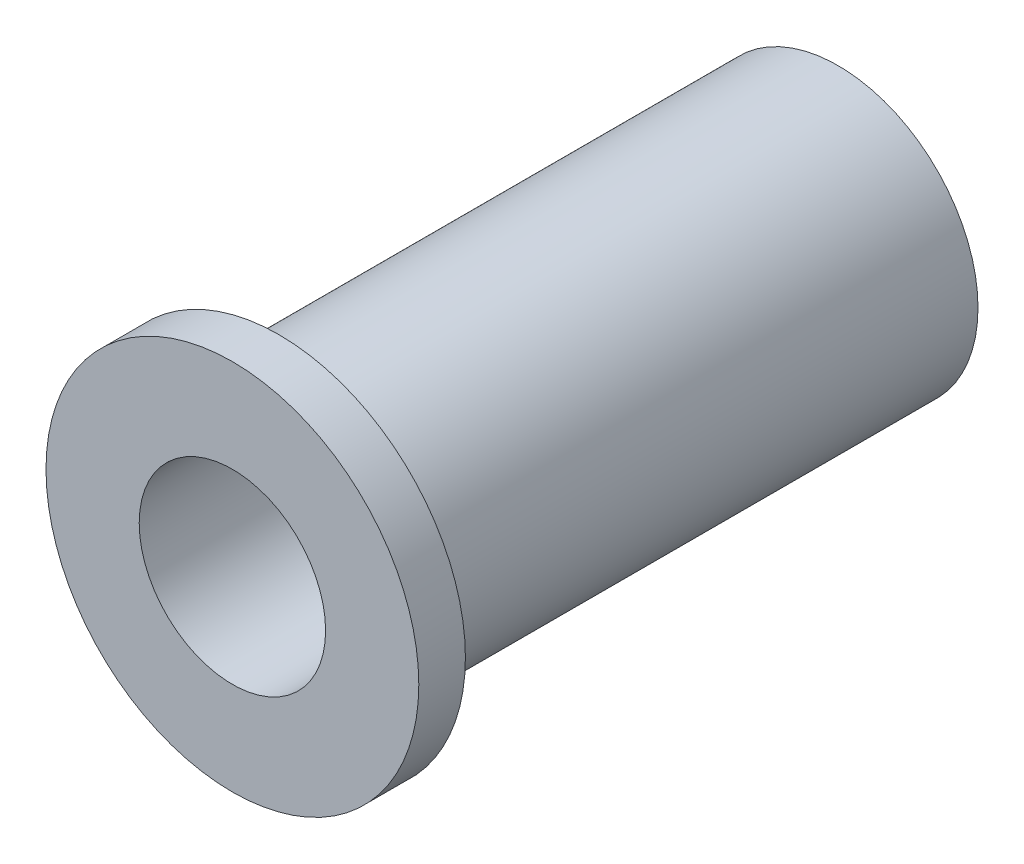
ISO-10303-21;
HEADER;
FILE_DESCRIPTION(('STEP AP214'),'2;1');
FILE_NAME('part.step','',(''),(''),'','','');
FILE_SCHEMA(('AUTOMOTIVE_DESIGN { 1 0 10303 214 1 1 1 1 }'));
ENDSEC;
DATA;
#1=APPLICATION_CONTEXT('core data for automotive mechanical design processes');
#2=APPLICATION_PROTOCOL_DEFINITION('international standard','automotive_design',2000,#1);
#3=PRODUCT_CONTEXT('',#1,'mechanical');
#4=PRODUCT('Part','Part','',(#3));
#5=PRODUCT_RELATED_PRODUCT_CATEGORY('part','',(#4));
#6=PRODUCT_DEFINITION_FORMATION('','',#4);
#7=PRODUCT_DEFINITION_CONTEXT('part definition',#1,'design');
#8=PRODUCT_DEFINITION('design','',#6,#7);
#9=PRODUCT_DEFINITION_SHAPE('','',#8);
#10=(LENGTH_UNIT() NAMED_UNIT(*) SI_UNIT(.MILLI.,.METRE.));
#11=(NAMED_UNIT(*) PLANE_ANGLE_UNIT() SI_UNIT($,.RADIAN.));
#12=(NAMED_UNIT(*) SI_UNIT($,.STERADIAN.) SOLID_ANGLE_UNIT());
#13=UNCERTAINTY_MEASURE_WITH_UNIT(LENGTH_MEASURE(1.E-05),#10,'distance_accuracy_value','');
#14=(GEOMETRIC_REPRESENTATION_CONTEXT(3) GLOBAL_UNCERTAINTY_ASSIGNED_CONTEXT((#13)) GLOBAL_UNIT_ASSIGNED_CONTEXT((#10,
#11,#12)) REPRESENTATION_CONTEXT('',''));
#15=CARTESIAN_POINT('',(0.,0.,0.));
#16=DIRECTION('',(0.,0.,1.));
#17=DIRECTION('',(1.,0.,0.));
#18=AXIS2_PLACEMENT_3D('',#15,#16,#17);
#19=CARTESIAN_POINT('',(0.,0.,0.));
#20=DIRECTION('',(0.,0.,1.));
#21=DIRECTION('',(1.,0.,0.));
#22=AXIS2_PLACEMENT_3D('',#19,#20,#21);
#23=PLANE('',#22);
#24=CARTESIAN_POINT('',(0.,0.,0.));
#25=DIRECTION('',(0.,0.,1.));
#26=DIRECTION('',(1.,0.,0.));
#27=AXIS2_PLACEMENT_3D('',#24,#25,#26);
#28=CIRCLE('',#27,4.7625);
#29=CARTESIAN_POINT('',(4.7625,0.,0.));
#30=VERTEX_POINT('',#29);
#31=EDGE_CURVE('E35',#30,#30,#28,.T.);
#32=ORIENTED_EDGE('',*,*,#31,.F.);
#33=EDGE_LOOP('',(#32));
#34=FACE_BOUND('',#33,.T.);
#35=CARTESIAN_POINT('',(0.,0.,0.));
#36=DIRECTION('',(0.,0.,1.));
#37=DIRECTION('',(1.,0.,0.));
#38=AXIS2_PLACEMENT_3D('',#35,#36,#37);
#39=CIRCLE('',#38,3.175);
#40=CARTESIAN_POINT('',(3.175,0.,0.));
#41=VERTEX_POINT('',#40);
#42=EDGE_CURVE('E42',#41,#41,#39,.T.);
#43=ORIENTED_EDGE('',*,*,#42,.T.);
#44=EDGE_LOOP('',(#43));
#45=FACE_BOUND('',#44,.T.);
#46=ADVANCED_FACE('F31',(#34,#45),#23,.F.);
#47=CARTESIAN_POINT('',(0.,0.,19.05));
#48=DIRECTION('',(0.,0.,-1.));
#49=DIRECTION('',(-1.,0.,0.));
#50=AXIS2_PLACEMENT_3D('',#47,#48,#49);
#51=CYLINDRICAL_SURFACE('',#50,4.7625);
#52=CARTESIAN_POINT('',(0.,0.,19.05));
#53=DIRECTION('',(0.,0.,1.));
#54=DIRECTION('',(1.,0.,0.));
#55=AXIS2_PLACEMENT_3D('',#52,#53,#54);
#56=CIRCLE('',#55,4.7625);
#57=CARTESIAN_POINT('',(4.7625,0.,19.05));
#58=VERTEX_POINT('',#57);
#59=EDGE_CURVE('E10',#58,#58,#56,.T.);
#60=ORIENTED_EDGE('',*,*,#59,.F.);
#61=EDGE_LOOP('',(#60));
#62=FACE_BOUND('',#61,.T.);
#63=ORIENTED_EDGE('',*,*,#31,.T.);
#64=EDGE_LOOP('',(#63));
#65=FACE_BOUND('',#64,.T.);
#66=ADVANCED_FACE('F33',(#62,#65),#51,.T.);
#67=CARTESIAN_POINT('',(0.,0.,19.05));
#68=DIRECTION('',(0.,0.,-1.));
#69=DIRECTION('',(-1.,0.,0.));
#70=AXIS2_PLACEMENT_3D('',#67,#68,#69);
#71=CYLINDRICAL_SURFACE('',#70,3.175);
#72=ORIENTED_EDGE('',*,*,#42,.F.);
#73=EDGE_LOOP('',(#72));
#74=FACE_BOUND('',#73,.T.);
#75=CARTESIAN_POINT('',(0.,0.,20.6375));
#76=DIRECTION('',(0.,0.,1.));
#77=DIRECTION('',(1.,0.,0.));
#78=AXIS2_PLACEMENT_3D('',#75,#76,#77);
#79=CIRCLE('',#78,3.175);
#80=CARTESIAN_POINT('',(3.175,0.,20.6375));
#81=VERTEX_POINT('',#80);
#82=EDGE_CURVE('E50',#81,#81,#79,.T.);
#83=ORIENTED_EDGE('',*,*,#82,.T.);
#84=EDGE_LOOP('',(#83));
#85=FACE_BOUND('',#84,.T.);
#86=ADVANCED_FACE('F56',(#74,#85),#71,.F.);
#87=CARTESIAN_POINT('',(0.,0.,19.05));
#88=DIRECTION('',(0.,0.,1.));
#89=DIRECTION('',(1.,0.,0.));
#90=AXIS2_PLACEMENT_3D('',#87,#88,#89);
#91=PLANE('',#90);
#92=CARTESIAN_POINT('',(0.,0.,19.05));
#93=DIRECTION('',(0.,0.,1.));
#94=DIRECTION('',(1.,0.,0.));
#95=AXIS2_PLACEMENT_3D('',#92,#93,#94);
#96=CIRCLE('',#95,6.35);
#97=CARTESIAN_POINT('',(6.35,0.,19.05));
#98=VERTEX_POINT('',#97);
#99=EDGE_CURVE('E47',#98,#98,#96,.T.);
#100=ORIENTED_EDGE('',*,*,#99,.F.);
#101=EDGE_LOOP('',(#100));
#102=FACE_BOUND('',#101,.T.);
#103=ORIENTED_EDGE('',*,*,#59,.T.);
#104=EDGE_LOOP('',(#103));
#105=FACE_BOUND('',#104,.T.);
#106=ADVANCED_FACE('F61',(#102,#105),#91,.F.);
#107=CARTESIAN_POINT('',(0.,0.,20.6375));
#108=DIRECTION('',(0.,0.,1.));
#109=DIRECTION('',(1.,0.,0.));
#110=AXIS2_PLACEMENT_3D('',#107,#108,#109);
#111=PLANE('',#110);
#112=CARTESIAN_POINT('',(0.,0.,20.6375));
#113=DIRECTION('',(0.,0.,1.));
#114=DIRECTION('',(1.,0.,0.));
#115=AXIS2_PLACEMENT_3D('',#112,#113,#114);
#116=CIRCLE('',#115,6.35);
#117=CARTESIAN_POINT('',(6.35,0.,20.6375));
#118=VERTEX_POINT('',#117);
#119=EDGE_CURVE('E46',#118,#118,#116,.T.);
#120=ORIENTED_EDGE('',*,*,#119,.T.);
#121=EDGE_LOOP('',(#120));
#122=FACE_BOUND('',#121,.T.);
#123=ORIENTED_EDGE('',*,*,#82,.F.);
#124=EDGE_LOOP('',(#123));
#125=FACE_BOUND('',#124,.T.);
#126=ADVANCED_FACE('F58',(#122,#125),#111,.T.);
#127=CARTESIAN_POINT('',(0.,0.,20.6375));
#128=DIRECTION('',(0.,0.,-1.));
#129=DIRECTION('',(-1.,0.,0.));
#130=AXIS2_PLACEMENT_3D('',#127,#128,#129);
#131=CYLINDRICAL_SURFACE('',#130,6.35);
#132=ORIENTED_EDGE('',*,*,#119,.F.);
#133=EDGE_LOOP('',(#132));
#134=FACE_BOUND('',#133,.T.);
#135=ORIENTED_EDGE('',*,*,#99,.T.);
#136=EDGE_LOOP('',(#135));
#137=FACE_BOUND('',#136,.T.);
#138=ADVANCED_FACE('F60',(#134,#137),#131,.T.);
#139=CLOSED_SHELL('',(#46,#66,#86,#106,#126,#138));
#140=MANIFOLD_SOLID_BREP('B2',#139);
#141=ADVANCED_BREP_SHAPE_REPRESENTATION('',(#18,#140),#14);
#142=SHAPE_DEFINITION_REPRESENTATION(#9,#141);
ENDSEC;
END-ISO-10303-21;
